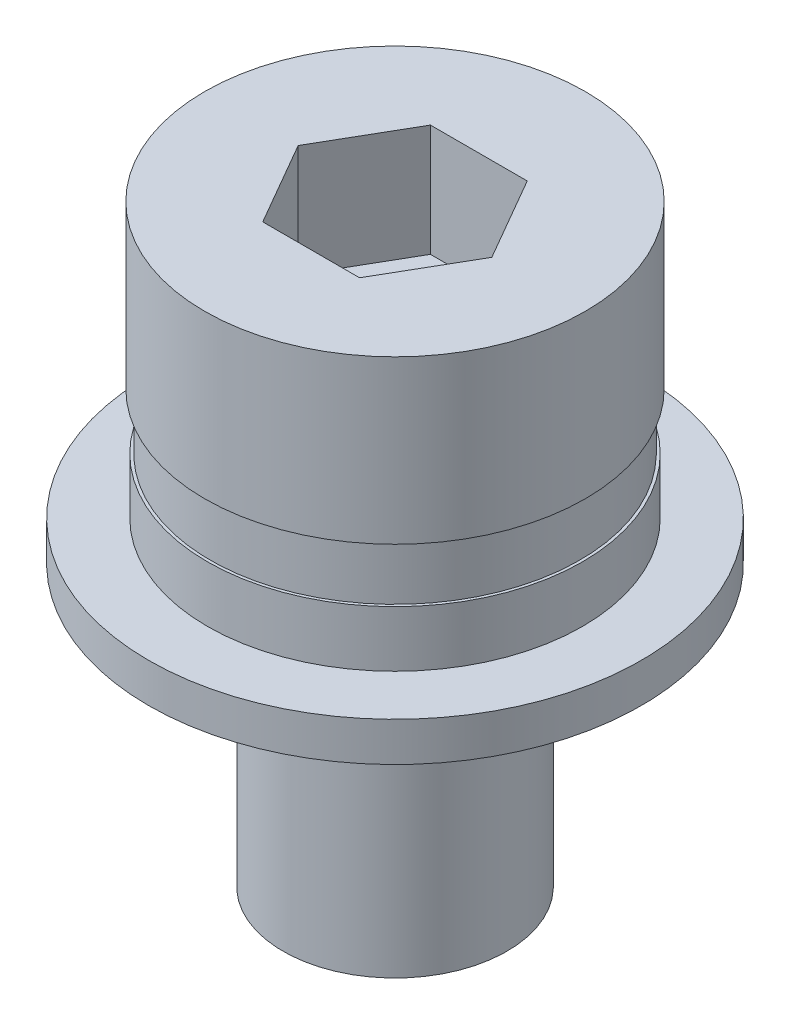
ISO-10303-21;
HEADER;
FILE_DESCRIPTION(('STEP AP214'),'2;1');
FILE_NAME('part.step','',(''),(''),'','','');
FILE_SCHEMA(('AUTOMOTIVE_DESIGN { 1 0 10303 214 1 1 1 1 }'));
ENDSEC;
DATA;
#1=APPLICATION_CONTEXT('core data for automotive mechanical design processes');
#2=APPLICATION_PROTOCOL_DEFINITION('international standard','automotive_design',2000,#1);
#3=PRODUCT_CONTEXT('',#1,'mechanical');
#4=PRODUCT('Part','Part','',(#3));
#5=PRODUCT_RELATED_PRODUCT_CATEGORY('part','',(#4));
#6=PRODUCT_DEFINITION_FORMATION('','',#4);
#7=PRODUCT_DEFINITION_CONTEXT('part definition',#1,'design');
#8=PRODUCT_DEFINITION('design','',#6,#7);
#9=PRODUCT_DEFINITION_SHAPE('','',#8);
#10=(LENGTH_UNIT() NAMED_UNIT(*) SI_UNIT(.MILLI.,.METRE.));
#11=(NAMED_UNIT(*) PLANE_ANGLE_UNIT() SI_UNIT($,.RADIAN.));
#12=(NAMED_UNIT(*) SI_UNIT($,.STERADIAN.) SOLID_ANGLE_UNIT());
#13=UNCERTAINTY_MEASURE_WITH_UNIT(LENGTH_MEASURE(1.E-05),#10,'distance_accuracy_value','');
#14=(GEOMETRIC_REPRESENTATION_CONTEXT(3) GLOBAL_UNCERTAINTY_ASSIGNED_CONTEXT((#13)) GLOBAL_UNIT_ASSIGNED_CONTEXT((#10,
#11,#12)) REPRESENTATION_CONTEXT('',''));
#15=CARTESIAN_POINT('',(0.,0.,0.));
#16=DIRECTION('',(0.,0.,1.));
#17=DIRECTION('',(1.,0.,0.));
#18=AXIS2_PLACEMENT_3D('',#15,#16,#17);
#19=CARTESIAN_POINT('',(0.,0.7,0.));
#20=DIRECTION('',(0.,-1.,0.));
#21=DIRECTION('',(0.,0.,-1.));
#22=AXIS2_PLACEMENT_3D('',#19,#20,#21);
#23=CYLINDRICAL_SURFACE('',#22,4.4);
#24=CARTESIAN_POINT('',(0.,0.7,0.));
#25=DIRECTION('',(0.,1.,0.));
#26=DIRECTION('',(0.,0.,1.));
#27=AXIS2_PLACEMENT_3D('',#24,#25,#26);
#28=CIRCLE('',#27,4.4);
#29=CARTESIAN_POINT('',(0.,0.7,4.4));
#30=VERTEX_POINT('',#29);
#31=EDGE_CURVE('E160',#30,#30,#28,.T.);
#32=ORIENTED_EDGE('',*,*,#31,.F.);
#33=EDGE_LOOP('',(#32));
#34=FACE_BOUND('',#33,.T.);
#35=CARTESIAN_POINT('',(0.,0.,0.));
#36=DIRECTION('',(0.,1.,0.));
#37=DIRECTION('',(0.,0.,1.));
#38=AXIS2_PLACEMENT_3D('',#35,#36,#37);
#39=CIRCLE('',#38,4.4);
#40=CARTESIAN_POINT('',(0.,0.,4.4));
#41=VERTEX_POINT('',#40);
#42=EDGE_CURVE('E157',#41,#41,#39,.T.);
#43=ORIENTED_EDGE('',*,*,#42,.T.);
#44=EDGE_LOOP('',(#43));
#45=FACE_BOUND('',#44,.T.);
#46=ADVANCED_FACE('F36',(#34,#45),#23,.T.);
#47=CARTESIAN_POINT('',(0.,0.7,0.));
#48=DIRECTION('',(0.,1.,0.));
#49=DIRECTION('',(0.,0.,1.));
#50=AXIS2_PLACEMENT_3D('',#47,#48,#49);
#51=PLANE('',#50);
#52=CARTESIAN_POINT('',(0.,0.7,0.));
#53=DIRECTION('',(0.,1.,0.));
#54=DIRECTION('',(0.,0.,1.));
#55=AXIS2_PLACEMENT_3D('',#52,#53,#54);
#56=CIRCLE('',#55,3.35);
#57=CARTESIAN_POINT('',(0.,0.7,3.35));
#58=VERTEX_POINT('',#57);
#59=EDGE_CURVE('E44',#58,#58,#56,.T.);
#60=ORIENTED_EDGE('',*,*,#59,.F.);
#61=EDGE_LOOP('',(#60));
#62=FACE_BOUND('',#61,.T.);
#63=ORIENTED_EDGE('',*,*,#31,.T.);
#64=EDGE_LOOP('',(#63));
#65=FACE_BOUND('',#64,.T.);
#66=ADVANCED_FACE('F169',(#62,#65),#51,.T.);
#67=CARTESIAN_POINT('',(0.,0.,0.));
#68=DIRECTION('',(0.,1.,0.));
#69=DIRECTION('',(0.,0.,1.));
#70=AXIS2_PLACEMENT_3D('',#67,#68,#69);
#71=PLANE('',#70);
#72=CARTESIAN_POINT('',(0.,0.,0.));
#73=DIRECTION('',(0.,-1.,0.));
#74=DIRECTION('',(0.,0.,-1.));
#75=AXIS2_PLACEMENT_3D('',#72,#73,#74);
#76=CIRCLE('',#75,2.);
#77=CARTESIAN_POINT('',(0.,0.,-2.));
#78=VERTEX_POINT('',#77);
#79=EDGE_CURVE('E11',#78,#78,#76,.T.);
#80=ORIENTED_EDGE('',*,*,#79,.F.);
#81=EDGE_LOOP('',(#80));
#82=FACE_BOUND('',#81,.T.);
#83=ORIENTED_EDGE('',*,*,#42,.F.);
#84=EDGE_LOOP('',(#83));
#85=FACE_BOUND('',#84,.T.);
#86=ADVANCED_FACE('F166',(#82,#85),#71,.F.);
#87=CARTESIAN_POINT('',(0.,1.7,0.));
#88=DIRECTION('',(0.,-1.,0.));
#89=DIRECTION('',(0.,0.,-1.));
#90=AXIS2_PLACEMENT_3D('',#87,#88,#89);
#91=CYLINDRICAL_SURFACE('',#90,3.35);
#92=CARTESIAN_POINT('',(0.,1.7,0.));
#93=DIRECTION('',(0.,-1.,0.));
#94=DIRECTION('',(0.,0.,-1.));
#95=AXIS2_PLACEMENT_3D('',#92,#93,#94);
#96=CIRCLE('',#95,3.35);
#97=CARTESIAN_POINT('',(0.,1.7,-3.35));
#98=VERTEX_POINT('',#97);
#99=EDGE_CURVE('E149',#98,#98,#96,.T.);
#100=ORIENTED_EDGE('',*,*,#99,.T.);
#101=EDGE_LOOP('',(#100));
#102=FACE_BOUND('',#101,.T.);
#103=ORIENTED_EDGE('',*,*,#59,.T.);
#104=EDGE_LOOP('',(#103));
#105=FACE_BOUND('',#104,.T.);
#106=ADVANCED_FACE('F168',(#102,#105),#91,.T.);
#107=CARTESIAN_POINT('',(0.,2.7,0.));
#108=DIRECTION('',(0.,-1.,0.));
#109=DIRECTION('',(0.,0.,-1.));
#110=AXIS2_PLACEMENT_3D('',#107,#108,#109);
#111=PLANE('',#110);
#112=CARTESIAN_POINT('',(0.,2.7,0.));
#113=DIRECTION('',(0.,-1.,0.));
#114=DIRECTION('',(0.,0.,-1.));
#115=AXIS2_PLACEMENT_3D('',#112,#113,#114);
#116=CIRCLE('',#115,3.3);
#117=CARTESIAN_POINT('',(0.,2.7,-3.3));
#118=VERTEX_POINT('',#117);
#119=EDGE_CURVE('E146',#118,#118,#116,.T.);
#120=ORIENTED_EDGE('',*,*,#119,.F.);
#121=EDGE_LOOP('',(#120));
#122=FACE_BOUND('',#121,.T.);
#123=CARTESIAN_POINT('',(0.,2.7,0.));
#124=DIRECTION('',(0.,-1.,0.));
#125=DIRECTION('',(0.,0.,-1.));
#126=AXIS2_PLACEMENT_3D('',#123,#124,#125);
#127=CIRCLE('',#126,3.4);
#128=CARTESIAN_POINT('',(0.,2.7,-3.4));
#129=VERTEX_POINT('',#128);
#130=EDGE_CURVE('E39',#129,#129,#127,.T.);
#131=ORIENTED_EDGE('',*,*,#130,.T.);
#132=EDGE_LOOP('',(#131));
#133=FACE_BOUND('',#132,.T.);
#134=ADVANCED_FACE('F175',(#122,#133),#111,.T.);
#135=CARTESIAN_POINT('',(0.,1.7,0.));
#136=DIRECTION('',(0.,-1.,0.));
#137=DIRECTION('',(0.,0.,-1.));
#138=AXIS2_PLACEMENT_3D('',#135,#136,#137);
#139=PLANE('',#138);
#140=CARTESIAN_POINT('',(0.,1.7,0.));
#141=DIRECTION('',(0.,-1.,0.));
#142=DIRECTION('',(0.,0.,-1.));
#143=AXIS2_PLACEMENT_3D('',#140,#141,#142);
#144=CIRCLE('',#143,3.3);
#145=CARTESIAN_POINT('',(0.,1.7,-3.3));
#146=VERTEX_POINT('',#145);
#147=EDGE_CURVE('E140',#146,#146,#144,.T.);
#148=ORIENTED_EDGE('',*,*,#147,.T.);
#149=EDGE_LOOP('',(#148));
#150=FACE_BOUND('',#149,.T.);
#151=ORIENTED_EDGE('',*,*,#99,.F.);
#152=EDGE_LOOP('',(#151));
#153=FACE_BOUND('',#152,.T.);
#154=ADVANCED_FACE('F208',(#150,#153),#139,.F.);
#155=CARTESIAN_POINT('',(0.,2.7,0.));
#156=DIRECTION('',(0.,-1.,0.));
#157=DIRECTION('',(0.,0.,-1.));
#158=AXIS2_PLACEMENT_3D('',#155,#156,#157);
#159=CYLINDRICAL_SURFACE('',#158,3.3);
#160=ORIENTED_EDGE('',*,*,#119,.T.);
#161=EDGE_LOOP('',(#160));
#162=FACE_BOUND('',#161,.T.);
#163=ORIENTED_EDGE('',*,*,#147,.F.);
#164=EDGE_LOOP('',(#163));
#165=FACE_BOUND('',#164,.T.);
#166=ADVANCED_FACE('F219',(#162,#165),#159,.T.);
#167=CARTESIAN_POINT('',(0.,5.6,0.));
#168=DIRECTION('',(0.,1.,0.));
#169=DIRECTION('',(0.,0.,1.));
#170=AXIS2_PLACEMENT_3D('',#167,#168,#169);
#171=PLANE('',#170);
#172=DIRECTION('',(-0.5,0.,0.866025403784439));
#173=VECTOR('',#172,1.);
#174=CARTESIAN_POINT('',(-0.864658064035032,5.6,-1.49763169808282));
#175=LINE('',#174,#173);
#176=CARTESIAN_POINT('',(-0.864658064035032,5.6,-1.49763169808282));
#177=VERTEX_POINT('',#176);
#178=CARTESIAN_POINT('',(-1.72931612807006,5.6,0.));
#179=VERTEX_POINT('',#178);
#180=EDGE_CURVE('E52',#177,#179,#175,.T.);
#181=ORIENTED_EDGE('',*,*,#180,.F.);
#182=DIRECTION('',(-1.,0.,0.));
#183=VECTOR('',#182,1.);
#184=CARTESIAN_POINT('',(0.864658064035031,5.6,-1.49763169808282));
#185=LINE('',#184,#183);
#186=CARTESIAN_POINT('',(0.864658064035031,5.6,-1.49763169808282));
#187=VERTEX_POINT('',#186);
#188=EDGE_CURVE('E136',#187,#177,#185,.T.);
#189=ORIENTED_EDGE('',*,*,#188,.F.);
#190=DIRECTION('',(-0.5,0.,-0.866025403784438));
#191=VECTOR('',#190,1.);
#192=CARTESIAN_POINT('',(1.72931612807006,5.6,0.));
#193=LINE('',#192,#191);
#194=CARTESIAN_POINT('',(1.72931612807006,5.6,0.));
#195=VERTEX_POINT('',#194);
#196=EDGE_CURVE('E134',#195,#187,#193,.T.);
#197=ORIENTED_EDGE('',*,*,#196,.F.);
#198=DIRECTION('',(0.5,0.,-0.866025403784439));
#199=VECTOR('',#198,1.);
#200=CARTESIAN_POINT('',(0.864658064035032,5.6,1.49763169808282));
#201=LINE('',#200,#199);
#202=CARTESIAN_POINT('',(0.864658064035032,5.6,1.49763169808282));
#203=VERTEX_POINT('',#202);
#204=EDGE_CURVE('E100',#203,#195,#201,.T.);
#205=ORIENTED_EDGE('',*,*,#204,.F.);
#206=DIRECTION('',(1.,0.,0.));
#207=VECTOR('',#206,1.);
#208=CARTESIAN_POINT('',(-0.864658064035032,5.6,1.49763169808282));
#209=LINE('',#208,#207);
#210=CARTESIAN_POINT('',(-0.864658064035032,5.6,1.49763169808282));
#211=VERTEX_POINT('',#210);
#212=EDGE_CURVE('E130',#211,#203,#209,.T.);
#213=ORIENTED_EDGE('',*,*,#212,.F.);
#214=DIRECTION('',(0.5,0.,0.866025403784438));
#215=VECTOR('',#214,1.);
#216=CARTESIAN_POINT('',(-1.72931612807006,5.6,0.));
#217=LINE('',#216,#215);
#218=EDGE_CURVE('E126',#179,#211,#217,.T.);
#219=ORIENTED_EDGE('',*,*,#218,.F.);
#220=EDGE_LOOP('',(#181,#189,#197,#205,#213,#219));
#221=FACE_BOUND('',#220,.T.);
#222=CARTESIAN_POINT('',(0.,5.6,0.));
#223=DIRECTION('',(0.,1.,0.));
#224=DIRECTION('',(0.,0.,1.));
#225=AXIS2_PLACEMENT_3D('',#222,#223,#224);
#226=CIRCLE('',#225,3.4);
#227=CARTESIAN_POINT('',(0.,5.6,3.4));
#228=VERTEX_POINT('',#227);
#229=EDGE_CURVE('E154',#228,#228,#226,.T.);
#230=ORIENTED_EDGE('',*,*,#229,.T.);
#231=EDGE_LOOP('',(#230));
#232=FACE_BOUND('',#231,.T.);
#233=ADVANCED_FACE('F229',(#221,#232),#171,.T.);
#234=CARTESIAN_POINT('',(0.,5.6,0.));
#235=DIRECTION('',(0.,-1.,0.));
#236=DIRECTION('',(0.,0.,-1.));
#237=AXIS2_PLACEMENT_3D('',#234,#235,#236);
#238=CYLINDRICAL_SURFACE('',#237,3.4);
#239=ORIENTED_EDGE('',*,*,#229,.F.);
#240=EDGE_LOOP('',(#239));
#241=FACE_BOUND('',#240,.T.);
#242=ORIENTED_EDGE('',*,*,#130,.F.);
#243=EDGE_LOOP('',(#242));
#244=FACE_BOUND('',#243,.T.);
#245=ADVANCED_FACE('F237',(#241,#244),#238,.T.);
#246=CARTESIAN_POINT('',(-0.864658064035032,3.6,-1.49763169808282));
#247=DIRECTION('',(-0.866025403784439,0.,-0.5));
#248=DIRECTION('',(-0.5,0.,0.866025403784439));
#249=AXIS2_PLACEMENT_3D('',#246,#247,#248);
#250=PLANE('',#249);
#251=ORIENTED_EDGE('',*,*,#180,.T.);
#252=DIRECTION('',(0.,1.,0.));
#253=VECTOR('',#252,1.);
#254=CARTESIAN_POINT('',(-1.72931612807006,3.6,0.));
#255=LINE('',#254,#253);
#256=CARTESIAN_POINT('',(-1.72931612807006,3.6,0.));
#257=VERTEX_POINT('',#256);
#258=EDGE_CURVE('E82',#257,#179,#255,.T.);
#259=ORIENTED_EDGE('',*,*,#258,.F.);
#260=DIRECTION('',(-0.5,0.,0.866025403784439));
#261=VECTOR('',#260,1.);
#262=CARTESIAN_POINT('',(-0.864658064035032,3.6,-1.49763169808282));
#263=LINE('',#262,#261);
#264=CARTESIAN_POINT('',(-0.864658064035032,3.6,-1.49763169808282));
#265=VERTEX_POINT('',#264);
#266=EDGE_CURVE('E138',#265,#257,#263,.T.);
#267=ORIENTED_EDGE('',*,*,#266,.F.);
#268=DIRECTION('',(0.,1.,0.));
#269=VECTOR('',#268,1.);
#270=CARTESIAN_POINT('',(-0.864658064035032,3.6,-1.49763169808282));
#271=LINE('',#270,#269);
#272=EDGE_CURVE('E60',#265,#177,#271,.T.);
#273=ORIENTED_EDGE('',*,*,#272,.T.);
#274=EDGE_LOOP('',(#251,#259,#267,#273));
#275=FACE_BOUND('',#274,.T.);
#276=ADVANCED_FACE('F241',(#275),#250,.F.);
#277=CARTESIAN_POINT('',(0.864658064035031,3.6,-1.49763169808282));
#278=DIRECTION('',(0.,0.,-1.));
#279=DIRECTION('',(-1.,0.,0.));
#280=AXIS2_PLACEMENT_3D('',#277,#278,#279);
#281=PLANE('',#280);
#282=ORIENTED_EDGE('',*,*,#188,.T.);
#283=ORIENTED_EDGE('',*,*,#272,.F.);
#284=DIRECTION('',(-1.,0.,0.));
#285=VECTOR('',#284,1.);
#286=CARTESIAN_POINT('',(0.864658064035031,3.6,-1.49763169808282));
#287=LINE('',#286,#285);
#288=CARTESIAN_POINT('',(0.864658064035031,3.6,-1.49763169808282));
#289=VERTEX_POINT('',#288);
#290=EDGE_CURVE('E112',#289,#265,#287,.T.);
#291=ORIENTED_EDGE('',*,*,#290,.F.);
#292=DIRECTION('',(0.,1.,0.));
#293=VECTOR('',#292,1.);
#294=CARTESIAN_POINT('',(0.864658064035031,3.6,-1.49763169808282));
#295=LINE('',#294,#293);
#296=EDGE_CURVE('E104',#289,#187,#295,.T.);
#297=ORIENTED_EDGE('',*,*,#296,.T.);
#298=EDGE_LOOP('',(#282,#283,#291,#297));
#299=FACE_BOUND('',#298,.T.);
#300=ADVANCED_FACE('F257',(#299),#281,.F.);
#301=CARTESIAN_POINT('',(1.72931612807006,3.6,0.));
#302=DIRECTION('',(0.866025403784438,0.,-0.5));
#303=DIRECTION('',(-0.5,0.,-0.866025403784439));
#304=AXIS2_PLACEMENT_3D('',#301,#302,#303);
#305=PLANE('',#304);
#306=ORIENTED_EDGE('',*,*,#196,.T.);
#307=ORIENTED_EDGE('',*,*,#296,.F.);
#308=DIRECTION('',(-0.5,0.,-0.866025403784438));
#309=VECTOR('',#308,1.);
#310=CARTESIAN_POINT('',(1.72931612807006,3.6,0.));
#311=LINE('',#310,#309);
#312=CARTESIAN_POINT('',(1.72931612807006,3.6,0.));
#313=VERTEX_POINT('',#312);
#314=EDGE_CURVE('E108',#313,#289,#311,.T.);
#315=ORIENTED_EDGE('',*,*,#314,.F.);
#316=DIRECTION('',(0.,1.,0.));
#317=VECTOR('',#316,1.);
#318=CARTESIAN_POINT('',(1.72931612807006,3.6,0.));
#319=LINE('',#318,#317);
#320=EDGE_CURVE('E93',#313,#195,#319,.T.);
#321=ORIENTED_EDGE('',*,*,#320,.T.);
#322=EDGE_LOOP('',(#306,#307,#315,#321));
#323=FACE_BOUND('',#322,.T.);
#324=ADVANCED_FACE('F109',(#323),#305,.F.);
#325=CARTESIAN_POINT('',(0.864658064035032,3.6,1.49763169808282));
#326=DIRECTION('',(0.866025403784439,0.,0.5));
#327=DIRECTION('',(0.5,0.,-0.866025403784439));
#328=AXIS2_PLACEMENT_3D('',#325,#326,#327);
#329=PLANE('',#328);
#330=ORIENTED_EDGE('',*,*,#204,.T.);
#331=ORIENTED_EDGE('',*,*,#320,.F.);
#332=DIRECTION('',(0.5,0.,-0.866025403784439));
#333=VECTOR('',#332,1.);
#334=CARTESIAN_POINT('',(0.864658064035032,3.6,1.49763169808282));
#335=LINE('',#334,#333);
#336=CARTESIAN_POINT('',(0.864658064035032,3.6,1.49763169808282));
#337=VERTEX_POINT('',#336);
#338=EDGE_CURVE('E97',#337,#313,#335,.T.);
#339=ORIENTED_EDGE('',*,*,#338,.F.);
#340=DIRECTION('',(0.,1.,0.));
#341=VECTOR('',#340,1.);
#342=CARTESIAN_POINT('',(0.864658064035032,3.6,1.49763169808282));
#343=LINE('',#342,#341);
#344=EDGE_CURVE('E105',#337,#203,#343,.T.);
#345=ORIENTED_EDGE('',*,*,#344,.T.);
#346=EDGE_LOOP('',(#330,#331,#339,#345));
#347=FACE_BOUND('',#346,.T.);
#348=ADVANCED_FACE('F95',(#347),#329,.F.);
#349=CARTESIAN_POINT('',(-0.864658064035032,3.6,1.49763169808282));
#350=DIRECTION('',(0.,0.,1.));
#351=DIRECTION('',(1.,0.,0.));
#352=AXIS2_PLACEMENT_3D('',#349,#350,#351);
#353=PLANE('',#352);
#354=ORIENTED_EDGE('',*,*,#212,.T.);
#355=ORIENTED_EDGE('',*,*,#344,.F.);
#356=DIRECTION('',(1.,0.,0.));
#357=VECTOR('',#356,1.);
#358=CARTESIAN_POINT('',(-0.864658064035032,3.6,1.49763169808282));
#359=LINE('',#358,#357);
#360=CARTESIAN_POINT('',(-0.864658064035032,3.6,1.49763169808282));
#361=VERTEX_POINT('',#360);
#362=EDGE_CURVE('E118',#361,#337,#359,.T.);
#363=ORIENTED_EDGE('',*,*,#362,.F.);
#364=DIRECTION('',(0.,1.,0.));
#365=VECTOR('',#364,1.);
#366=CARTESIAN_POINT('',(-0.864658064035032,3.6,1.49763169808282));
#367=LINE('',#366,#365);
#368=EDGE_CURVE('E143',#361,#211,#367,.T.);
#369=ORIENTED_EDGE('',*,*,#368,.T.);
#370=EDGE_LOOP('',(#354,#355,#363,#369));
#371=FACE_BOUND('',#370,.T.);
#372=ADVANCED_FACE('F282',(#371),#353,.F.);
#373=CARTESIAN_POINT('',(-1.72931612807006,3.6,0.));
#374=DIRECTION('',(-0.866025403784438,0.,0.5));
#375=DIRECTION('',(0.5,0.,0.866025403784439));
#376=AXIS2_PLACEMENT_3D('',#373,#374,#375);
#377=PLANE('',#376);
#378=ORIENTED_EDGE('',*,*,#218,.T.);
#379=ORIENTED_EDGE('',*,*,#368,.F.);
#380=DIRECTION('',(0.5,0.,0.866025403784438));
#381=VECTOR('',#380,1.);
#382=CARTESIAN_POINT('',(-1.72931612807006,3.6,0.));
#383=LINE('',#382,#381);
#384=EDGE_CURVE('E120',#257,#361,#383,.T.);
#385=ORIENTED_EDGE('',*,*,#384,.F.);
#386=ORIENTED_EDGE('',*,*,#258,.T.);
#387=EDGE_LOOP('',(#378,#379,#385,#386));
#388=FACE_BOUND('',#387,.T.);
#389=ADVANCED_FACE('F291',(#388),#377,.F.);
#390=CARTESIAN_POINT('',(0.,3.6,0.));
#391=DIRECTION('',(0.,1.,0.));
#392=DIRECTION('',(0.,0.,1.));
#393=AXIS2_PLACEMENT_3D('',#390,#391,#392);
#394=PLANE('',#393);
#395=ORIENTED_EDGE('',*,*,#266,.T.);
#396=ORIENTED_EDGE('',*,*,#384,.T.);
#397=ORIENTED_EDGE('',*,*,#362,.T.);
#398=ORIENTED_EDGE('',*,*,#338,.T.);
#399=ORIENTED_EDGE('',*,*,#314,.T.);
#400=ORIENTED_EDGE('',*,*,#290,.T.);
#401=EDGE_LOOP('',(#395,#396,#397,#398,#399,#400));
#402=FACE_BOUND('',#401,.T.);
#403=ADVANCED_FACE('F115',(#402),#394,.T.);
#404=CARTESIAN_POINT('',(0.,-5.,0.));
#405=DIRECTION('',(0.,1.,0.));
#406=DIRECTION('',(0.,0.,1.));
#407=AXIS2_PLACEMENT_3D('',#404,#405,#406);
#408=CYLINDRICAL_SURFACE('',#407,2.);
#409=CARTESIAN_POINT('',(0.,-5.,0.));
#410=DIRECTION('',(0.,-1.,0.));
#411=DIRECTION('',(0.,0.,-1.));
#412=AXIS2_PLACEMENT_3D('',#409,#410,#411);
#413=CIRCLE('',#412,2.);
#414=CARTESIAN_POINT('',(0.,-5.,-2.));
#415=VERTEX_POINT('',#414);
#416=EDGE_CURVE('E127',#415,#415,#413,.T.);
#417=ORIENTED_EDGE('',*,*,#416,.F.);
#418=EDGE_LOOP('',(#417));
#419=FACE_BOUND('',#418,.T.);
#420=ORIENTED_EDGE('',*,*,#79,.T.);
#421=EDGE_LOOP('',(#420));
#422=FACE_BOUND('',#421,.T.);
#423=ADVANCED_FACE('F309',(#419,#422),#408,.T.);
#424=CARTESIAN_POINT('',(0.,-5.,0.));
#425=DIRECTION('',(0.,-1.,0.));
#426=DIRECTION('',(0.,0.,-1.));
#427=AXIS2_PLACEMENT_3D('',#424,#425,#426);
#428=PLANE('',#427);
#429=ORIENTED_EDGE('',*,*,#416,.T.);
#430=EDGE_LOOP('',(#429));
#431=FACE_BOUND('',#430,.T.);
#432=ADVANCED_FACE('F322',(#431),#428,.T.);
#433=CLOSED_SHELL('',(#46,#66,#86,#106,#134,#154,#166,#233,#245,#276,#300,#324,#348,#372,#389,
#403,#423,#432));
#434=MANIFOLD_SOLID_BREP('B2',#433);
#435=ADVANCED_BREP_SHAPE_REPRESENTATION('',(#18,#434),#14);
#436=SHAPE_DEFINITION_REPRESENTATION(#9,#435);
ENDSEC;
END-ISO-10303-21;
